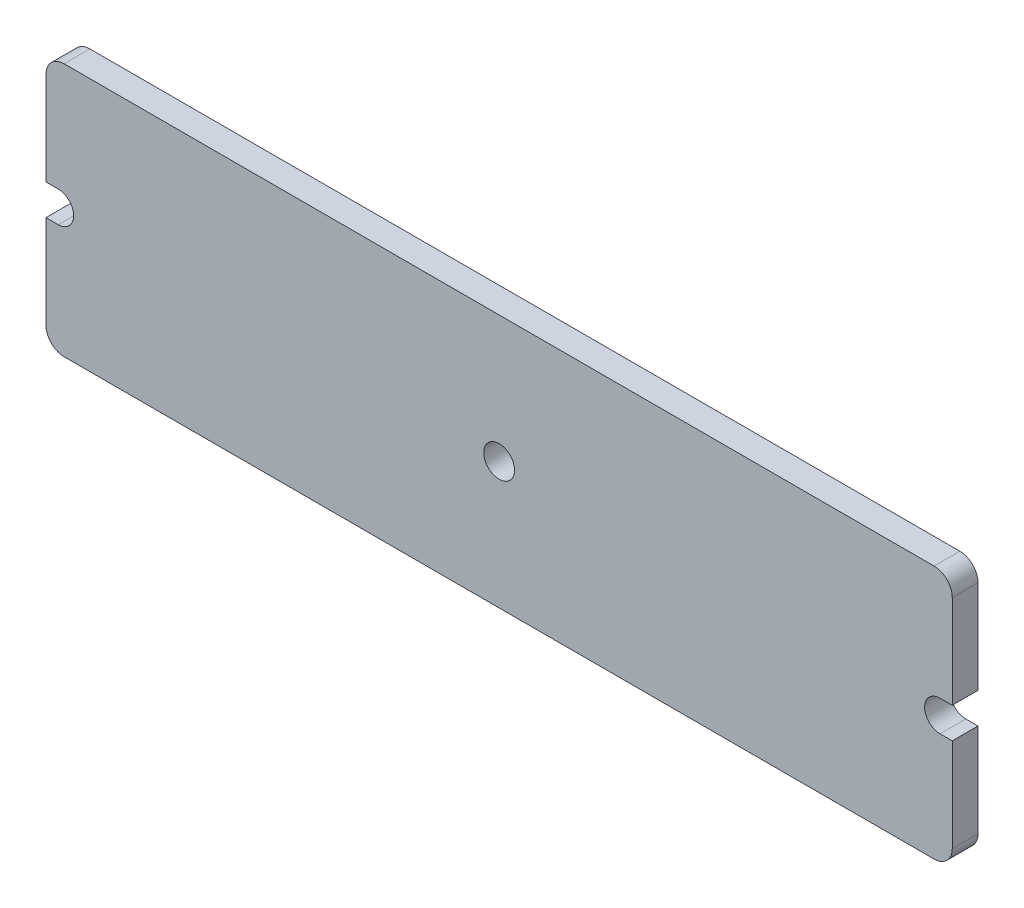
ISO-10303-21;
HEADER;
FILE_DESCRIPTION(('STEP AP214'),'2;1');
FILE_NAME('part.step','',(''),(''),'','','');
FILE_SCHEMA(('AUTOMOTIVE_DESIGN { 1 0 10303 214 1 1 1 1 }'));
ENDSEC;
DATA;
#1=APPLICATION_CONTEXT('core data for automotive mechanical design processes');
#2=APPLICATION_PROTOCOL_DEFINITION('international standard','automotive_design',2000,#1);
#3=PRODUCT_CONTEXT('',#1,'mechanical');
#4=PRODUCT('Part','Part','',(#3));
#5=PRODUCT_RELATED_PRODUCT_CATEGORY('part','',(#4));
#6=PRODUCT_DEFINITION_FORMATION('','',#4);
#7=PRODUCT_DEFINITION_CONTEXT('part definition',#1,'design');
#8=PRODUCT_DEFINITION('design','',#6,#7);
#9=PRODUCT_DEFINITION_SHAPE('','',#8);
#10=(LENGTH_UNIT() NAMED_UNIT(*) SI_UNIT(.MILLI.,.METRE.));
#11=(NAMED_UNIT(*) PLANE_ANGLE_UNIT() SI_UNIT($,.RADIAN.));
#12=(NAMED_UNIT(*) SI_UNIT($,.STERADIAN.) SOLID_ANGLE_UNIT());
#13=UNCERTAINTY_MEASURE_WITH_UNIT(LENGTH_MEASURE(1.E-05),#10,'distance_accuracy_value','');
#14=(GEOMETRIC_REPRESENTATION_CONTEXT(3) GLOBAL_UNCERTAINTY_ASSIGNED_CONTEXT((#13)) GLOBAL_UNIT_ASSIGNED_CONTEXT((#10,
#11,#12)) REPRESENTATION_CONTEXT('',''));
#15=CARTESIAN_POINT('',(0.,0.,0.));
#16=DIRECTION('',(0.,0.,1.));
#17=DIRECTION('',(1.,0.,0.));
#18=AXIS2_PLACEMENT_3D('',#15,#16,#17);
#19=CARTESIAN_POINT('',(12.0007277218209,52.0007277218209,0.));
#20=DIRECTION('',(0.,0.,-1.));
#21=DIRECTION('',(-0.000363728539775849,-0.999999933850772,0.));
#22=AXIS2_PLACEMENT_3D('',#19,#20,#21);
#23=CYLINDRICAL_SURFACE('',#22,2.00072785416749);
#24=DIRECTION('',(0.,0.,1.));
#25=VECTOR('',#24,1.);
#26=CARTESIAN_POINT('',(12.,50.,0.));
#27=LINE('',#26,#25);
#28=CARTESIAN_POINT('',(12.,50.,0.));
#29=VERTEX_POINT('',#28);
#30=CARTESIAN_POINT('',(12.,50.,2.84031944));
#31=VERTEX_POINT('',#30);
#32=EDGE_CURVE('E10',#29,#31,#27,.T.);
#33=ORIENTED_EDGE('',*,*,#32,.T.);
#34=CARTESIAN_POINT('',(12.0007277218209,52.0007277218209,2.84031944));
#35=DIRECTION('',(0.,0.,-1.));
#36=DIRECTION('',(-0.000363728539775849,-0.999999933850772,0.));
#37=AXIS2_PLACEMENT_3D('',#34,#35,#36);
#38=CIRCLE('',#37,2.00072785416749);
#39=CARTESIAN_POINT('',(10.,52.,2.84031944));
#40=VERTEX_POINT('',#39);
#41=EDGE_CURVE('E23',#31,#40,#38,.T.);
#42=ORIENTED_EDGE('',*,*,#41,.T.);
#43=DIRECTION('',(0.,0.,1.));
#44=VECTOR('',#43,1.);
#45=CARTESIAN_POINT('',(10.,52.,0.));
#46=LINE('',#45,#44);
#47=CARTESIAN_POINT('',(10.,52.,0.));
#48=VERTEX_POINT('',#47);
#49=EDGE_CURVE('E264',#48,#40,#46,.T.);
#50=ORIENTED_EDGE('',*,*,#49,.F.);
#51=CARTESIAN_POINT('',(12.0007277218209,52.0007277218209,0.));
#52=DIRECTION('',(0.,0.,-1.));
#53=DIRECTION('',(-0.000363728539775849,-0.999999933850772,0.));
#54=AXIS2_PLACEMENT_3D('',#51,#52,#53);
#55=CIRCLE('',#54,2.00072785416749);
#56=EDGE_CURVE('E261',#29,#48,#55,.T.);
#57=ORIENTED_EDGE('',*,*,#56,.F.);
#58=EDGE_LOOP('',(#33,#42,#50,#57));
#59=FACE_BOUND('',#58,.T.);
#60=ADVANCED_FACE('F16',(#59),#23,.T.);
#61=CARTESIAN_POINT('',(10.,52.,0.));
#62=DIRECTION('',(-1.,0.,0.));
#63=DIRECTION('',(0.,1.,0.));
#64=AXIS2_PLACEMENT_3D('',#61,#62,#63);
#65=PLANE('',#64);
#66=ORIENTED_EDGE('',*,*,#49,.T.);
#67=DIRECTION('',(0.,1.,0.));
#68=VECTOR('',#67,1.);
#69=CARTESIAN_POINT('',(10.,52.,2.84031944));
#70=LINE('',#69,#68);
#71=CARTESIAN_POINT('',(10.,62.298999786377,2.84031944));
#72=VERTEX_POINT('',#71);
#73=EDGE_CURVE('E258',#40,#72,#70,.T.);
#74=ORIENTED_EDGE('',*,*,#73,.T.);
#75=DIRECTION('',(0.,0.,1.));
#76=VECTOR('',#75,1.);
#77=CARTESIAN_POINT('',(10.,62.298999786377,0.));
#78=LINE('',#77,#76);
#79=CARTESIAN_POINT('',(10.,62.298999786377,0.));
#80=VERTEX_POINT('',#79);
#81=EDGE_CURVE('E255',#80,#72,#78,.T.);
#82=ORIENTED_EDGE('',*,*,#81,.F.);
#83=DIRECTION('',(0.,1.,0.));
#84=VECTOR('',#83,1.);
#85=CARTESIAN_POINT('',(10.,52.,0.));
#86=LINE('',#85,#84);
#87=EDGE_CURVE('E252',#48,#80,#86,.T.);
#88=ORIENTED_EDGE('',*,*,#87,.F.);
#89=EDGE_LOOP('',(#66,#74,#82,#88));
#90=FACE_BOUND('',#89,.T.);
#91=ADVANCED_FACE('F271',(#90),#65,.T.);
#92=CARTESIAN_POINT('',(10.,62.298999786377,0.));
#93=DIRECTION('',(0.,1.,0.));
#94=DIRECTION('',(1.,0.,0.));
#95=AXIS2_PLACEMENT_3D('',#92,#93,#94);
#96=PLANE('',#95);
#97=ORIENTED_EDGE('',*,*,#81,.T.);
#98=DIRECTION('',(1.,0.,0.));
#99=VECTOR('',#98,1.);
#100=CARTESIAN_POINT('',(10.,62.298999786377,2.84031944));
#101=LINE('',#100,#99);
#102=CARTESIAN_POINT('',(11.3500003814697,62.298999786377,2.84031944));
#103=VERTEX_POINT('',#102);
#104=EDGE_CURVE('E249',#72,#103,#101,.T.);
#105=ORIENTED_EDGE('',*,*,#104,.T.);
#106=DIRECTION('',(0.,0.,1.));
#107=VECTOR('',#106,1.);
#108=CARTESIAN_POINT('',(11.3500003814697,62.298999786377,0.));
#109=LINE('',#108,#107);
#110=CARTESIAN_POINT('',(11.3500003814697,62.298999786377,0.));
#111=VERTEX_POINT('',#110);
#112=EDGE_CURVE('E246',#111,#103,#109,.T.);
#113=ORIENTED_EDGE('',*,*,#112,.F.);
#114=DIRECTION('',(1.,0.,0.));
#115=VECTOR('',#114,1.);
#116=CARTESIAN_POINT('',(10.,62.298999786377,0.));
#117=LINE('',#116,#115);
#118=EDGE_CURVE('E243',#80,#111,#117,.T.);
#119=ORIENTED_EDGE('',*,*,#118,.F.);
#120=EDGE_LOOP('',(#97,#105,#113,#119));
#121=FACE_BOUND('',#120,.T.);
#122=ADVANCED_FACE('F278',(#121),#96,.T.);
#123=CARTESIAN_POINT('',(11.3500013351448,63.9999980926514,0.));
#124=DIRECTION('',(0.,0.,-1.));
#125=DIRECTION('',(-5.60656125171673E-07,-0.999999999999843,0.));
#126=AXIS2_PLACEMENT_3D('',#123,#124,#125);
#127=CYLINDRICAL_SURFACE('',#126,1.70099830627468);
#128=ORIENTED_EDGE('',*,*,#112,.T.);
#129=CARTESIAN_POINT('',(11.3500013351448,63.9999980926514,2.84031944));
#130=DIRECTION('',(0.,0.,1.));
#131=DIRECTION('',(-5.60656125171673E-07,-0.999999999999843,0.));
#132=AXIS2_PLACEMENT_3D('',#129,#130,#131);
#133=CIRCLE('',#132,1.70099830627468);
#134=CARTESIAN_POINT('',(11.3500003814697,65.7009963989258,2.84031944));
#135=VERTEX_POINT('',#134);
#136=EDGE_CURVE('E241',#103,#135,#133,.T.);
#137=ORIENTED_EDGE('',*,*,#136,.T.);
#138=DIRECTION('',(0.,0.,1.));
#139=VECTOR('',#138,1.);
#140=CARTESIAN_POINT('',(11.3500003814697,65.7009963989258,0.));
#141=LINE('',#140,#139);
#142=CARTESIAN_POINT('',(11.3500003814697,65.7009963989258,0.));
#143=VERTEX_POINT('',#142);
#144=EDGE_CURVE('E238',#143,#135,#141,.T.);
#145=ORIENTED_EDGE('',*,*,#144,.F.);
#146=CARTESIAN_POINT('',(11.3500013351448,63.9999980926514,0.));
#147=DIRECTION('',(0.,0.,1.));
#148=DIRECTION('',(-5.60656125171673E-07,-0.999999999999843,0.));
#149=AXIS2_PLACEMENT_3D('',#146,#147,#148);
#150=CIRCLE('',#149,1.70099830627468);
#151=EDGE_CURVE('E235',#111,#143,#150,.T.);
#152=ORIENTED_EDGE('',*,*,#151,.F.);
#153=EDGE_LOOP('',(#128,#137,#145,#152));
#154=FACE_BOUND('',#153,.T.);
#155=ADVANCED_FACE('F324',(#154),#127,.F.);
#156=CARTESIAN_POINT('',(11.3500003814697,65.7009963989258,0.));
#157=DIRECTION('',(0.,-1.,0.));
#158=DIRECTION('',(-1.,0.,0.));
#159=AXIS2_PLACEMENT_3D('',#156,#157,#158);
#160=PLANE('',#159);
#161=ORIENTED_EDGE('',*,*,#144,.T.);
#162=DIRECTION('',(-1.,0.,0.));
#163=VECTOR('',#162,1.);
#164=CARTESIAN_POINT('',(11.3500003814697,65.7009963989258,2.84031944));
#165=LINE('',#164,#163);
#166=CARTESIAN_POINT('',(10.,65.7009963989258,2.84031944));
#167=VERTEX_POINT('',#166);
#168=EDGE_CURVE('E232',#135,#167,#165,.T.);
#169=ORIENTED_EDGE('',*,*,#168,.T.);
#170=DIRECTION('',(0.,0.,1.));
#171=VECTOR('',#170,1.);
#172=CARTESIAN_POINT('',(10.,65.7009963989258,0.));
#173=LINE('',#172,#171);
#174=CARTESIAN_POINT('',(10.,65.7009963989258,0.));
#175=VERTEX_POINT('',#174);
#176=EDGE_CURVE('E230',#175,#167,#173,.T.);
#177=ORIENTED_EDGE('',*,*,#176,.F.);
#178=DIRECTION('',(-1.,0.,0.));
#179=VECTOR('',#178,1.);
#180=CARTESIAN_POINT('',(11.3500003814697,65.7009963989258,0.));
#181=LINE('',#180,#179);
#182=EDGE_CURVE('E227',#143,#175,#181,.T.);
#183=ORIENTED_EDGE('',*,*,#182,.F.);
#184=EDGE_LOOP('',(#161,#169,#177,#183));
#185=FACE_BOUND('',#184,.T.);
#186=ADVANCED_FACE('F321',(#185),#160,.T.);
#187=CARTESIAN_POINT('',(10.,65.7009963989258,0.));
#188=DIRECTION('',(-1.,0.,0.));
#189=DIRECTION('',(0.,1.,0.));
#190=AXIS2_PLACEMENT_3D('',#187,#188,#189);
#191=PLANE('',#190);
#192=ORIENTED_EDGE('',*,*,#176,.T.);
#193=DIRECTION('',(0.,1.,0.));
#194=VECTOR('',#193,1.);
#195=CARTESIAN_POINT('',(10.,65.7009963989258,2.84031944));
#196=LINE('',#195,#194);
#197=CARTESIAN_POINT('',(10.,76.,2.84031944));
#198=VERTEX_POINT('',#197);
#199=EDGE_CURVE('E224',#167,#198,#196,.T.);
#200=ORIENTED_EDGE('',*,*,#199,.T.);
#201=DIRECTION('',(0.,0.,1.));
#202=VECTOR('',#201,1.);
#203=CARTESIAN_POINT('',(10.,76.,0.));
#204=LINE('',#203,#202);
#205=CARTESIAN_POINT('',(10.,76.,0.));
#206=VERTEX_POINT('',#205);
#207=EDGE_CURVE('E222',#206,#198,#204,.T.);
#208=ORIENTED_EDGE('',*,*,#207,.F.);
#209=DIRECTION('',(0.,1.,0.));
#210=VECTOR('',#209,1.);
#211=CARTESIAN_POINT('',(10.,65.7009963989258,0.));
#212=LINE('',#211,#210);
#213=EDGE_CURVE('E219',#175,#206,#212,.T.);
#214=ORIENTED_EDGE('',*,*,#213,.F.);
#215=EDGE_LOOP('',(#192,#200,#208,#214));
#216=FACE_BOUND('',#215,.T.);
#217=ADVANCED_FACE('F319',(#216),#191,.T.);
#218=CARTESIAN_POINT('',(12.0007277218209,75.9992722781791,0.));
#219=DIRECTION('',(0.,0.,-1.));
#220=DIRECTION('',(-0.999999933850772,0.000363728539773186,0.));
#221=AXIS2_PLACEMENT_3D('',#218,#219,#220);
#222=CYLINDRICAL_SURFACE('',#221,2.00072785416749);
#223=ORIENTED_EDGE('',*,*,#207,.T.);
#224=CARTESIAN_POINT('',(12.0007277218209,75.9992722781791,2.84031944));
#225=DIRECTION('',(0.,0.,-1.));
#226=DIRECTION('',(-0.999999933850772,0.000363728539773186,0.));
#227=AXIS2_PLACEMENT_3D('',#224,#225,#226);
#228=CIRCLE('',#227,2.00072785416749);
#229=CARTESIAN_POINT('',(12.,78.,2.84031944));
#230=VERTEX_POINT('',#229);
#231=EDGE_CURVE('E216',#198,#230,#228,.T.);
#232=ORIENTED_EDGE('',*,*,#231,.T.);
#233=DIRECTION('',(0.,0.,1.));
#234=VECTOR('',#233,1.);
#235=CARTESIAN_POINT('',(12.,78.,0.));
#236=LINE('',#235,#234);
#237=CARTESIAN_POINT('',(12.,78.,0.));
#238=VERTEX_POINT('',#237);
#239=EDGE_CURVE('E214',#238,#230,#236,.T.);
#240=ORIENTED_EDGE('',*,*,#239,.F.);
#241=CARTESIAN_POINT('',(12.0007277218209,75.9992722781791,0.));
#242=DIRECTION('',(0.,0.,-1.));
#243=DIRECTION('',(-0.999999933850772,0.000363728539773186,0.));
#244=AXIS2_PLACEMENT_3D('',#241,#242,#243);
#245=CIRCLE('',#244,2.00072785416749);
#246=EDGE_CURVE('E211',#206,#238,#245,.T.);
#247=ORIENTED_EDGE('',*,*,#246,.F.);
#248=EDGE_LOOP('',(#223,#232,#240,#247));
#249=FACE_BOUND('',#248,.T.);
#250=ADVANCED_FACE('F315',(#249),#222,.T.);
#251=CARTESIAN_POINT('',(12.,78.,0.));
#252=DIRECTION('',(0.,1.,0.));
#253=DIRECTION('',(1.,0.,0.));
#254=AXIS2_PLACEMENT_3D('',#251,#252,#253);
#255=PLANE('',#254);
#256=ORIENTED_EDGE('',*,*,#239,.T.);
#257=DIRECTION('',(1.,0.,0.));
#258=VECTOR('',#257,1.);
#259=CARTESIAN_POINT('',(12.,78.,2.84031944));
#260=LINE('',#259,#258);
#261=CARTESIAN_POINT('',(108.,78.,2.84031944));
#262=VERTEX_POINT('',#261);
#263=EDGE_CURVE('E208',#230,#262,#260,.T.);
#264=ORIENTED_EDGE('',*,*,#263,.T.);
#265=DIRECTION('',(0.,0.,1.));
#266=VECTOR('',#265,1.);
#267=CARTESIAN_POINT('',(108.,78.,0.));
#268=LINE('',#267,#266);
#269=CARTESIAN_POINT('',(108.,78.,0.));
#270=VERTEX_POINT('',#269);
#271=EDGE_CURVE('E205',#270,#262,#268,.T.);
#272=ORIENTED_EDGE('',*,*,#271,.F.);
#273=DIRECTION('',(1.,0.,0.));
#274=VECTOR('',#273,1.);
#275=CARTESIAN_POINT('',(12.,78.,0.));
#276=LINE('',#275,#274);
#277=EDGE_CURVE('E202',#238,#270,#276,.T.);
#278=ORIENTED_EDGE('',*,*,#277,.F.);
#279=EDGE_LOOP('',(#256,#264,#272,#278));
#280=FACE_BOUND('',#279,.T.);
#281=ADVANCED_FACE('F311',(#280),#255,.T.);
#282=CARTESIAN_POINT('',(107.999275537081,75.9992755370806,0.));
#283=DIRECTION('',(0.,0.,-1.));
#284=DIRECTION('',(0.00036210027185361,0.999999934441694,0.));
#285=AXIS2_PLACEMENT_3D('',#282,#283,#284);
#286=CYLINDRICAL_SURFACE('',#285,2.00072459408354);
#287=ORIENTED_EDGE('',*,*,#271,.T.);
#288=CARTESIAN_POINT('',(107.999275537081,75.9992755370806,2.84031944));
#289=DIRECTION('',(0.,0.,-1.));
#290=DIRECTION('',(0.00036210027185361,0.999999934441694,0.));
#291=AXIS2_PLACEMENT_3D('',#288,#289,#290);
#292=CIRCLE('',#291,2.00072459408354);
#293=CARTESIAN_POINT('',(110.,76.,2.84031944));
#294=VERTEX_POINT('',#293);
#295=EDGE_CURVE('E199',#262,#294,#292,.T.);
#296=ORIENTED_EDGE('',*,*,#295,.T.);
#297=DIRECTION('',(0.,0.,1.));
#298=VECTOR('',#297,1.);
#299=CARTESIAN_POINT('',(110.,76.,0.));
#300=LINE('',#299,#298);
#301=CARTESIAN_POINT('',(110.,76.,0.));
#302=VERTEX_POINT('',#301);
#303=EDGE_CURVE('E197',#302,#294,#300,.T.);
#304=ORIENTED_EDGE('',*,*,#303,.F.);
#305=CARTESIAN_POINT('',(107.999275537081,75.9992755370806,0.));
#306=DIRECTION('',(0.,0.,-1.));
#307=DIRECTION('',(0.00036210027185361,0.999999934441694,0.));
#308=AXIS2_PLACEMENT_3D('',#305,#306,#307);
#309=CIRCLE('',#308,2.00072459408354);
#310=EDGE_CURVE('E194',#270,#302,#309,.T.);
#311=ORIENTED_EDGE('',*,*,#310,.F.);
#312=EDGE_LOOP('',(#287,#296,#304,#311));
#313=FACE_BOUND('',#312,.T.);
#314=ADVANCED_FACE('F307',(#313),#286,.T.);
#315=CARTESIAN_POINT('',(110.,76.,0.));
#316=DIRECTION('',(1.,0.,0.));
#317=DIRECTION('',(0.,-1.,0.));
#318=AXIS2_PLACEMENT_3D('',#315,#316,#317);
#319=PLANE('',#318);
#320=ORIENTED_EDGE('',*,*,#303,.T.);
#321=DIRECTION('',(0.,-1.,0.));
#322=VECTOR('',#321,1.);
#323=CARTESIAN_POINT('',(110.,76.,2.84031944));
#324=LINE('',#323,#322);
#325=CARTESIAN_POINT('',(110.,65.7009963989258,2.84031944));
#326=VERTEX_POINT('',#325);
#327=EDGE_CURVE('E191',#294,#326,#324,.T.);
#328=ORIENTED_EDGE('',*,*,#327,.T.);
#329=DIRECTION('',(0.,0.,1.));
#330=VECTOR('',#329,1.);
#331=CARTESIAN_POINT('',(110.,65.7009963989258,0.));
#332=LINE('',#331,#330);
#333=CARTESIAN_POINT('',(110.,65.7009963989258,0.));
#334=VERTEX_POINT('',#333);
#335=EDGE_CURVE('E189',#334,#326,#332,.T.);
#336=ORIENTED_EDGE('',*,*,#335,.F.);
#337=DIRECTION('',(0.,-1.,0.));
#338=VECTOR('',#337,1.);
#339=CARTESIAN_POINT('',(110.,76.,0.));
#340=LINE('',#339,#338);
#341=EDGE_CURVE('E186',#302,#334,#340,.T.);
#342=ORIENTED_EDGE('',*,*,#341,.F.);
#343=EDGE_LOOP('',(#320,#328,#336,#342));
#344=FACE_BOUND('',#343,.T.);
#345=ADVANCED_FACE('F304',(#344),#319,.T.);
#346=CARTESIAN_POINT('',(110.,65.7009963989258,0.));
#347=DIRECTION('',(0.,-1.,0.));
#348=DIRECTION('',(-1.,0.,0.));
#349=AXIS2_PLACEMENT_3D('',#346,#347,#348);
#350=PLANE('',#349);
#351=ORIENTED_EDGE('',*,*,#335,.T.);
#352=DIRECTION('',(-1.,0.,0.));
#353=VECTOR('',#352,1.);
#354=CARTESIAN_POINT('',(110.,65.7009963989258,2.84031944));
#355=LINE('',#354,#353);
#356=CARTESIAN_POINT('',(108.650001525879,65.7009963989258,2.84031944));
#357=VERTEX_POINT('',#356);
#358=EDGE_CURVE('E183',#326,#357,#355,.T.);
#359=ORIENTED_EDGE('',*,*,#358,.T.);
#360=DIRECTION('',(0.,0.,1.));
#361=VECTOR('',#360,1.);
#362=CARTESIAN_POINT('',(108.650001525879,65.7009963989258,0.));
#363=LINE('',#362,#361);
#364=CARTESIAN_POINT('',(108.650001525879,65.7009963989258,0.));
#365=VERTEX_POINT('',#364);
#366=EDGE_CURVE('E181',#365,#357,#363,.T.);
#367=ORIENTED_EDGE('',*,*,#366,.F.);
#368=DIRECTION('',(-1.,0.,0.));
#369=VECTOR('',#368,1.);
#370=CARTESIAN_POINT('',(110.,65.7009963989258,0.));
#371=LINE('',#370,#369);
#372=EDGE_CURVE('E178',#334,#365,#371,.T.);
#373=ORIENTED_EDGE('',*,*,#372,.F.);
#374=EDGE_LOOP('',(#351,#359,#367,#373));
#375=FACE_BOUND('',#374,.T.);
#376=ADVANCED_FACE('F300',(#375),#350,.T.);
#377=CARTESIAN_POINT('',(108.649995803842,63.9999980926514,0.));
#378=DIRECTION('',(0.,0.,-1.));
#379=DIRECTION('',(3.36392888950206E-06,0.999999999994342,0.));
#380=AXIS2_PLACEMENT_3D('',#377,#378,#379);
#381=CYLINDRICAL_SURFACE('',#380,1.70099830628404);
#382=ORIENTED_EDGE('',*,*,#366,.T.);
#383=CARTESIAN_POINT('',(108.649995803842,63.9999980926514,2.84031944));
#384=DIRECTION('',(0.,0.,1.));
#385=DIRECTION('',(3.36392888950206E-06,0.999999999994342,0.));
#386=AXIS2_PLACEMENT_3D('',#383,#384,#385);
#387=CIRCLE('',#386,1.70099830628404);
#388=CARTESIAN_POINT('',(108.650001525879,62.298999786377,2.84031944));
#389=VERTEX_POINT('',#388);
#390=EDGE_CURVE('E175',#357,#389,#387,.T.);
#391=ORIENTED_EDGE('',*,*,#390,.T.);
#392=DIRECTION('',(0.,0.,1.));
#393=VECTOR('',#392,1.);
#394=CARTESIAN_POINT('',(108.650001525879,62.298999786377,0.));
#395=LINE('',#394,#393);
#396=CARTESIAN_POINT('',(108.650001525879,62.298999786377,0.));
#397=VERTEX_POINT('',#396);
#398=EDGE_CURVE('E172',#397,#389,#395,.T.);
#399=ORIENTED_EDGE('',*,*,#398,.F.);
#400=CARTESIAN_POINT('',(108.649995803842,63.9999980926514,0.));
#401=DIRECTION('',(0.,0.,1.));
#402=DIRECTION('',(3.36392888950206E-06,0.999999999994342,0.));
#403=AXIS2_PLACEMENT_3D('',#400,#401,#402);
#404=CIRCLE('',#403,1.70099830628404);
#405=EDGE_CURVE('E169',#365,#397,#404,.T.);
#406=ORIENTED_EDGE('',*,*,#405,.F.);
#407=EDGE_LOOP('',(#382,#391,#399,#406));
#408=FACE_BOUND('',#407,.T.);
#409=ADVANCED_FACE('F297',(#408),#381,.F.);
#410=CARTESIAN_POINT('',(108.650001525879,62.298999786377,0.));
#411=DIRECTION('',(0.,1.,0.));
#412=DIRECTION('',(1.,0.,0.));
#413=AXIS2_PLACEMENT_3D('',#410,#411,#412);
#414=PLANE('',#413);
#415=ORIENTED_EDGE('',*,*,#398,.T.);
#416=DIRECTION('',(1.,0.,0.));
#417=VECTOR('',#416,1.);
#418=CARTESIAN_POINT('',(108.650001525879,62.298999786377,2.84031944));
#419=LINE('',#418,#417);
#420=CARTESIAN_POINT('',(110.,62.298999786377,2.84031944));
#421=VERTEX_POINT('',#420);
#422=EDGE_CURVE('E167',#389,#421,#419,.T.);
#423=ORIENTED_EDGE('',*,*,#422,.T.);
#424=DIRECTION('',(0.,0.,1.));
#425=VECTOR('',#424,1.);
#426=CARTESIAN_POINT('',(110.,62.298999786377,0.));
#427=LINE('',#426,#425);
#428=CARTESIAN_POINT('',(110.,62.298999786377,0.));
#429=VERTEX_POINT('',#428);
#430=EDGE_CURVE('E164',#429,#421,#427,.T.);
#431=ORIENTED_EDGE('',*,*,#430,.F.);
#432=DIRECTION('',(1.,0.,0.));
#433=VECTOR('',#432,1.);
#434=CARTESIAN_POINT('',(108.650001525879,62.298999786377,0.));
#435=LINE('',#434,#433);
#436=EDGE_CURVE('E162',#397,#429,#435,.T.);
#437=ORIENTED_EDGE('',*,*,#436,.F.);
#438=EDGE_LOOP('',(#415,#423,#431,#437));
#439=FACE_BOUND('',#438,.T.);
#440=ADVANCED_FACE('F294',(#439),#414,.T.);
#441=CARTESIAN_POINT('',(110.,62.298999786377,0.));
#442=DIRECTION('',(1.,0.,0.));
#443=DIRECTION('',(0.,-1.,0.));
#444=AXIS2_PLACEMENT_3D('',#441,#442,#443);
#445=PLANE('',#444);
#446=ORIENTED_EDGE('',*,*,#430,.T.);
#447=DIRECTION('',(0.,-1.,0.));
#448=VECTOR('',#447,1.);
#449=CARTESIAN_POINT('',(110.,62.298999786377,2.84031944));
#450=LINE('',#449,#448);
#451=CARTESIAN_POINT('',(110.,52.,2.84031944));
#452=VERTEX_POINT('',#451);
#453=EDGE_CURVE('E159',#421,#452,#450,.T.);
#454=ORIENTED_EDGE('',*,*,#453,.T.);
#455=DIRECTION('',(0.,0.,1.));
#456=VECTOR('',#455,1.);
#457=CARTESIAN_POINT('',(110.,52.,0.));
#458=LINE('',#457,#456);
#459=CARTESIAN_POINT('',(110.,52.,0.));
#460=VERTEX_POINT('',#459);
#461=EDGE_CURVE('E157',#460,#452,#458,.T.);
#462=ORIENTED_EDGE('',*,*,#461,.F.);
#463=DIRECTION('',(0.,-1.,0.));
#464=VECTOR('',#463,1.);
#465=CARTESIAN_POINT('',(110.,62.298999786377,0.));
#466=LINE('',#465,#464);
#467=EDGE_CURVE('E154',#429,#460,#466,.T.);
#468=ORIENTED_EDGE('',*,*,#467,.F.);
#469=EDGE_LOOP('',(#446,#454,#462,#468));
#470=FACE_BOUND('',#469,.T.);
#471=ADVANCED_FACE('F288',(#470),#445,.T.);
#472=CARTESIAN_POINT('',(107.999275537081,52.0007244629194,0.));
#473=DIRECTION('',(0.,0.,-1.));
#474=DIRECTION('',(0.999999934441694,-0.00036210027185361,0.));
#475=AXIS2_PLACEMENT_3D('',#472,#473,#474);
#476=CYLINDRICAL_SURFACE('',#475,2.00072459408354);
#477=ORIENTED_EDGE('',*,*,#461,.T.);
#478=CARTESIAN_POINT('',(107.999275537081,52.0007244629194,2.84031944));
#479=DIRECTION('',(0.,0.,-1.));
#480=DIRECTION('',(0.999999934441694,-0.00036210027185361,0.));
#481=AXIS2_PLACEMENT_3D('',#478,#479,#480);
#482=CIRCLE('',#481,2.00072459408354);
#483=CARTESIAN_POINT('',(108.,50.,2.84031944));
#484=VERTEX_POINT('',#483);
#485=EDGE_CURVE('E151',#452,#484,#482,.T.);
#486=ORIENTED_EDGE('',*,*,#485,.T.);
#487=DIRECTION('',(0.,0.,1.));
#488=VECTOR('',#487,1.);
#489=CARTESIAN_POINT('',(108.,50.,0.));
#490=LINE('',#489,#488);
#491=CARTESIAN_POINT('',(108.,50.,0.));
#492=VERTEX_POINT('',#491);
#493=EDGE_CURVE('E149',#492,#484,#490,.T.);
#494=ORIENTED_EDGE('',*,*,#493,.F.);
#495=CARTESIAN_POINT('',(107.999275537081,52.0007244629194,0.));
#496=DIRECTION('',(0.,0.,-1.));
#497=DIRECTION('',(0.999999934441694,-0.00036210027185361,0.));
#498=AXIS2_PLACEMENT_3D('',#495,#496,#497);
#499=CIRCLE('',#498,2.00072459408354);
#500=EDGE_CURVE('E146',#460,#492,#499,.T.);
#501=ORIENTED_EDGE('',*,*,#500,.F.);
#502=EDGE_LOOP('',(#477,#486,#494,#501));
#503=FACE_BOUND('',#502,.T.);
#504=ADVANCED_FACE('F285',(#503),#476,.T.);
#505=CARTESIAN_POINT('',(108.,50.,0.));
#506=DIRECTION('',(0.,-1.,0.));
#507=DIRECTION('',(-1.,0.,0.));
#508=AXIS2_PLACEMENT_3D('',#505,#506,#507);
#509=PLANE('',#508);
#510=ORIENTED_EDGE('',*,*,#493,.T.);
#511=DIRECTION('',(-1.,0.,0.));
#512=VECTOR('',#511,1.);
#513=CARTESIAN_POINT('',(108.,50.,2.84031944));
#514=LINE('',#513,#512);
#515=EDGE_CURVE('E144',#484,#31,#514,.T.);
#516=ORIENTED_EDGE('',*,*,#515,.T.);
#517=ORIENTED_EDGE('',*,*,#32,.F.);
#518=DIRECTION('',(-1.,0.,0.));
#519=VECTOR('',#518,1.);
#520=CARTESIAN_POINT('',(108.,50.,0.));
#521=LINE('',#520,#519);
#522=EDGE_CURVE('E141',#492,#29,#521,.T.);
#523=ORIENTED_EDGE('',*,*,#522,.F.);
#524=EDGE_LOOP('',(#510,#516,#517,#523));
#525=FACE_BOUND('',#524,.T.);
#526=ADVANCED_FACE('F281',(#525),#509,.T.);
#527=CARTESIAN_POINT('',(59.99999938,63.999999,0.));
#528=DIRECTION('',(0.,0.,-1.));
#529=DIRECTION('',(1.,0.,0.));
#530=AXIS2_PLACEMENT_3D('',#527,#528,#529);
#531=CYLINDRICAL_SURFACE('',#530,1.69999914);
#532=DIRECTION('',(0.,0.,1.));
#533=VECTOR('',#532,1.);
#534=CARTESIAN_POINT('',(61.69999852,63.999999,0.));
#535=LINE('',#534,#533);
#536=CARTESIAN_POINT('',(61.69999852,63.999999,0.));
#537=VERTEX_POINT('',#536);
#538=CARTESIAN_POINT('',(61.69999852,63.999999,2.84031944));
#539=VERTEX_POINT('',#538);
#540=EDGE_CURVE('E137',#537,#539,#535,.T.);
#541=ORIENTED_EDGE('',*,*,#540,.T.);
#542=CARTESIAN_POINT('',(59.99999938,63.999999,2.84031944));
#543=DIRECTION('',(0.,0.,1.));
#544=DIRECTION('',(1.,0.,0.));
#545=AXIS2_PLACEMENT_3D('',#542,#543,#544);
#546=CIRCLE('',#545,1.69999914);
#547=EDGE_CURVE('E134',#539,#539,#546,.T.);
#548=ORIENTED_EDGE('',*,*,#547,.T.);
#549=ORIENTED_EDGE('',*,*,#540,.F.);
#550=CARTESIAN_POINT('',(59.99999938,63.999999,0.));
#551=DIRECTION('',(0.,0.,1.));
#552=DIRECTION('',(1.,0.,0.));
#553=AXIS2_PLACEMENT_3D('',#550,#551,#552);
#554=CIRCLE('',#553,1.69999914);
#555=EDGE_CURVE('E130',#537,#537,#554,.T.);
#556=ORIENTED_EDGE('',*,*,#555,.F.);
#557=EDGE_LOOP('',(#541,#548,#549,#556));
#558=FACE_BOUND('',#557,.T.);
#559=ADVANCED_FACE('F451',(#558),#531,.F.);
#560=CARTESIAN_POINT('',(12.,50.,0.));
#561=DIRECTION('',(0.,0.,1.));
#562=DIRECTION('',(1.,0.,0.));
#563=AXIS2_PLACEMENT_3D('',#560,#561,#562);
#564=PLANE('',#563);
#565=ORIENTED_EDGE('',*,*,#56,.T.);
#566=ORIENTED_EDGE('',*,*,#87,.T.);
#567=ORIENTED_EDGE('',*,*,#118,.T.);
#568=ORIENTED_EDGE('',*,*,#151,.T.);
#569=ORIENTED_EDGE('',*,*,#182,.T.);
#570=ORIENTED_EDGE('',*,*,#213,.T.);
#571=ORIENTED_EDGE('',*,*,#246,.T.);
#572=ORIENTED_EDGE('',*,*,#277,.T.);
#573=ORIENTED_EDGE('',*,*,#310,.T.);
#574=ORIENTED_EDGE('',*,*,#341,.T.);
#575=ORIENTED_EDGE('',*,*,#372,.T.);
#576=ORIENTED_EDGE('',*,*,#405,.T.);
#577=ORIENTED_EDGE('',*,*,#436,.T.);
#578=ORIENTED_EDGE('',*,*,#467,.T.);
#579=ORIENTED_EDGE('',*,*,#500,.T.);
#580=ORIENTED_EDGE('',*,*,#522,.T.);
#581=EDGE_LOOP('',(#565,#566,#567,#568,#569,#570,#571,#572,#573,#574,#575,#576,#577,#578,#579,#580));
#582=FACE_BOUND('',#581,.T.);
#583=ORIENTED_EDGE('',*,*,#555,.T.);
#584=EDGE_LOOP('',(#583));
#585=FACE_BOUND('',#584,.T.);
#586=ADVANCED_FACE('F131',(#582,#585),#564,.F.);
#587=CARTESIAN_POINT('',(12.,50.,2.84031944));
#588=DIRECTION('',(0.,0.,1.));
#589=DIRECTION('',(1.,0.,0.));
#590=AXIS2_PLACEMENT_3D('',#587,#588,#589);
#591=PLANE('',#590);
#592=ORIENTED_EDGE('',*,*,#515,.F.);
#593=ORIENTED_EDGE('',*,*,#485,.F.);
#594=ORIENTED_EDGE('',*,*,#453,.F.);
#595=ORIENTED_EDGE('',*,*,#422,.F.);
#596=ORIENTED_EDGE('',*,*,#390,.F.);
#597=ORIENTED_EDGE('',*,*,#358,.F.);
#598=ORIENTED_EDGE('',*,*,#327,.F.);
#599=ORIENTED_EDGE('',*,*,#295,.F.);
#600=ORIENTED_EDGE('',*,*,#263,.F.);
#601=ORIENTED_EDGE('',*,*,#231,.F.);
#602=ORIENTED_EDGE('',*,*,#199,.F.);
#603=ORIENTED_EDGE('',*,*,#168,.F.);
#604=ORIENTED_EDGE('',*,*,#136,.F.);
#605=ORIENTED_EDGE('',*,*,#104,.F.);
#606=ORIENTED_EDGE('',*,*,#73,.F.);
#607=ORIENTED_EDGE('',*,*,#41,.F.);
#608=EDGE_LOOP('',(#592,#593,#594,#595,#596,#597,#598,#599,#600,#601,#602,#603,#604,#605,#606,#607));
#609=FACE_BOUND('',#608,.T.);
#610=ORIENTED_EDGE('',*,*,#547,.F.);
#611=EDGE_LOOP('',(#610));
#612=FACE_BOUND('',#611,.T.);
#613=ADVANCED_FACE('F272',(#609,#612),#591,.T.);
#614=CLOSED_SHELL('',(#60,#91,#122,#155,#186,#217,#250,#281,#314,#345,#376,#409,#440,#471,#504,
#526,#559,#586,#613));
#615=MANIFOLD_SOLID_BREP('B1',#614);
#616=ADVANCED_BREP_SHAPE_REPRESENTATION('',(#18,#615),#14);
#617=SHAPE_DEFINITION_REPRESENTATION(#9,#616);
ENDSEC;
END-ISO-10303-21;
